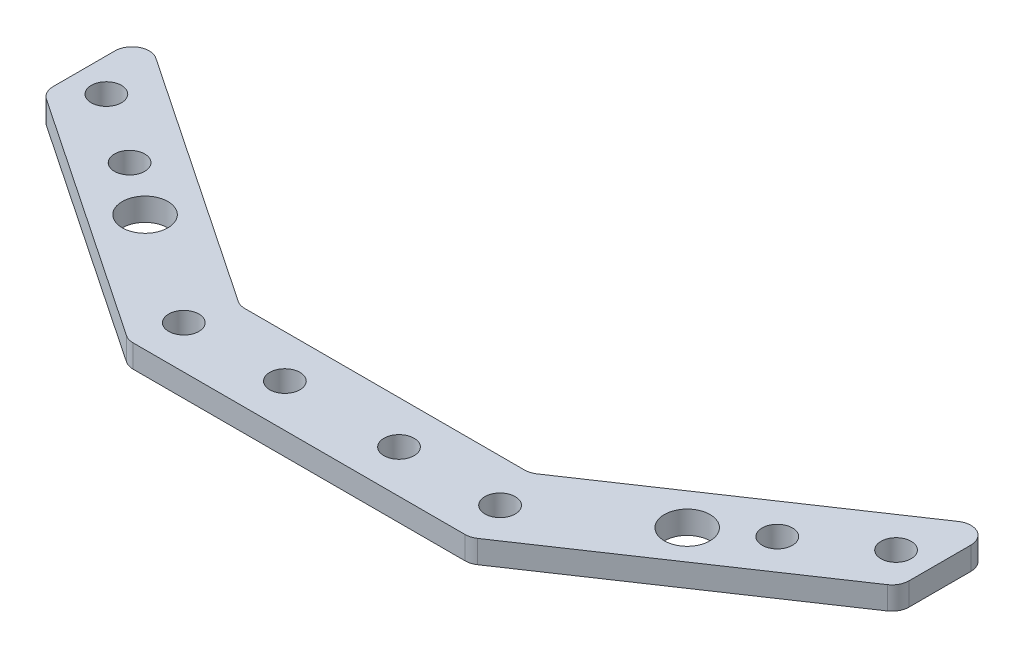
ISO-10303-21;
HEADER;
FILE_DESCRIPTION(('STEP AP214'),'2;1');
FILE_NAME('part.step','',(''),(''),'','','');
FILE_SCHEMA(('AUTOMOTIVE_DESIGN { 1 0 10303 214 1 1 1 1 }'));
ENDSEC;
DATA;
#1=APPLICATION_CONTEXT('core data for automotive mechanical design processes');
#2=APPLICATION_PROTOCOL_DEFINITION('international standard','automotive_design',2000,#1);
#3=PRODUCT_CONTEXT('',#1,'mechanical');
#4=PRODUCT('Part','Part','',(#3));
#5=PRODUCT_RELATED_PRODUCT_CATEGORY('part','',(#4));
#6=PRODUCT_DEFINITION_FORMATION('','',#4);
#7=PRODUCT_DEFINITION_CONTEXT('part definition',#1,'design');
#8=PRODUCT_DEFINITION('design','',#6,#7);
#9=PRODUCT_DEFINITION_SHAPE('','',#8);
#10=(LENGTH_UNIT() NAMED_UNIT(*) SI_UNIT(.MILLI.,.METRE.));
#11=(NAMED_UNIT(*) PLANE_ANGLE_UNIT() SI_UNIT($,.RADIAN.));
#12=(NAMED_UNIT(*) SI_UNIT($,.STERADIAN.) SOLID_ANGLE_UNIT());
#13=UNCERTAINTY_MEASURE_WITH_UNIT(LENGTH_MEASURE(1.E-05),#10,'distance_accuracy_value','');
#14=(GEOMETRIC_REPRESENTATION_CONTEXT(3) GLOBAL_UNCERTAINTY_ASSIGNED_CONTEXT((#13)) GLOBAL_UNIT_ASSIGNED_CONTEXT((#10,
#11,#12)) REPRESENTATION_CONTEXT('',''));
#15=CARTESIAN_POINT('',(0.,0.,0.));
#16=DIRECTION('',(0.,0.,1.));
#17=DIRECTION('',(1.,0.,0.));
#18=AXIS2_PLACEMENT_3D('',#15,#16,#17);
#19=CARTESIAN_POINT('',(0.,20.,0.));
#20=DIRECTION('',(0.,1.,0.));
#21=DIRECTION('',(0.,0.,1.));
#22=AXIS2_PLACEMENT_3D('',#19,#20,#21);
#23=PLANE('',#22);
#24=CARTESIAN_POINT('',(-47.5000000000011,20.,-205.5));
#25=DIRECTION('',(0.,-1.,0.));
#26=DIRECTION('',(0.,0.,-1.));
#27=AXIS2_PLACEMENT_3D('',#24,#25,#26);
#28=CIRCLE('',#27,4.00000000000001);
#29=CARTESIAN_POINT('',(-47.5000000000011,20.,-209.5));
#30=VERTEX_POINT('',#29);
#31=EDGE_CURVE('E398',#30,#30,#28,.T.);
#32=ORIENTED_EDGE('',*,*,#31,.T.);
#33=EDGE_LOOP('',(#32));
#34=FACE_BOUND('',#33,.T.);
#35=CARTESIAN_POINT('',(47.5000000000014,20.,-205.499999999999));
#36=DIRECTION('',(0.,-1.,0.));
#37=DIRECTION('',(0.,0.,1.));
#38=AXIS2_PLACEMENT_3D('',#35,#36,#37);
#39=CIRCLE('',#38,4.00000000000001);
#40=CARTESIAN_POINT('',(47.5000000000014,20.,-201.499999999999));
#41=VERTEX_POINT('',#40);
#42=EDGE_CURVE('E595',#41,#41,#39,.T.);
#43=ORIENTED_EDGE('',*,*,#42,.T.);
#44=EDGE_LOOP('',(#43));
#45=FACE_BOUND('',#44,.T.);
#46=CARTESIAN_POINT('',(10.,20.,-192.5));
#47=DIRECTION('',(0.,1.,0.));
#48=DIRECTION('',(0.,0.,-1.));
#49=AXIS2_PLACEMENT_3D('',#46,#47,#48);
#50=CIRCLE('',#49,2.65000000000001);
#51=CARTESIAN_POINT('',(10.,20.,-195.15));
#52=VERTEX_POINT('',#51);
#53=EDGE_CURVE('E222',#52,#52,#50,.T.);
#54=ORIENTED_EDGE('',*,*,#53,.F.);
#55=EDGE_LOOP('',(#54));
#56=FACE_BOUND('',#55,.T.);
#57=CARTESIAN_POINT('',(27.7116277384566,20.,-192.5));
#58=DIRECTION('',(0.,1.,0.));
#59=DIRECTION('',(0.,0.,-1.));
#60=AXIS2_PLACEMENT_3D('',#57,#58,#59);
#61=CIRCLE('',#60,2.65);
#62=CARTESIAN_POINT('',(27.7116277384566,20.,-195.15));
#63=VERTEX_POINT('',#62);
#64=EDGE_CURVE('E201',#63,#63,#61,.T.);
#65=ORIENTED_EDGE('',*,*,#64,.F.);
#66=EDGE_LOOP('',(#65));
#67=FACE_BOUND('',#66,.T.);
#68=CARTESIAN_POINT('',(69.1949044966264,20.,-220.413039057134));
#69=DIRECTION('',(0.,1.,0.));
#70=DIRECTION('',(0.,0.,-1.));
#71=AXIS2_PLACEMENT_3D('',#68,#69,#70);
#72=CIRCLE('',#71,2.65);
#73=CARTESIAN_POINT('',(69.1949044966264,20.,-223.063039057134));
#74=VERTEX_POINT('',#73);
#75=EDGE_CURVE('E205',#74,#74,#72,.T.);
#76=ORIENTED_EDGE('',*,*,#75,.F.);
#77=EDGE_LOOP('',(#76));
#78=FACE_BOUND('',#77,.T.);
#79=CARTESIAN_POINT('',(56.7499214691754,20.,-212.039127339994));
#80=DIRECTION('',(0.,1.,0.));
#81=DIRECTION('',(0.,0.,-1.));
#82=AXIS2_PLACEMENT_3D('',#79,#80,#81);
#83=CIRCLE('',#82,2.65);
#84=CARTESIAN_POINT('',(56.7499214691754,20.,-214.689127339994));
#85=VERTEX_POINT('',#84);
#86=EDGE_CURVE('E202',#85,#85,#83,.T.);
#87=ORIENTED_EDGE('',*,*,#86,.F.);
#88=EDGE_LOOP('',(#87));
#89=FACE_BOUND('',#88,.T.);
#90=CARTESIAN_POINT('',(-56.7499214691754,20.,-212.039127339994));
#91=DIRECTION('',(0.,1.,0.));
#92=DIRECTION('',(0.,0.,1.));
#93=AXIS2_PLACEMENT_3D('',#90,#91,#92);
#94=CIRCLE('',#93,2.65);
#95=CARTESIAN_POINT('',(-56.7499214691754,20.,-209.389127339994));
#96=VERTEX_POINT('',#95);
#97=EDGE_CURVE('E211',#96,#96,#94,.T.);
#98=ORIENTED_EDGE('',*,*,#97,.F.);
#99=EDGE_LOOP('',(#98));
#100=FACE_BOUND('',#99,.T.);
#101=CARTESIAN_POINT('',(-69.1949044966264,20.,-220.413039057134));
#102=DIRECTION('',(0.,1.,0.));
#103=DIRECTION('',(0.,0.,1.));
#104=AXIS2_PLACEMENT_3D('',#101,#102,#103);
#105=CIRCLE('',#104,2.65);
#106=CARTESIAN_POINT('',(-69.1949044966264,20.,-217.763039057134));
#107=VERTEX_POINT('',#106);
#108=EDGE_CURVE('E208',#107,#107,#105,.T.);
#109=ORIENTED_EDGE('',*,*,#108,.F.);
#110=EDGE_LOOP('',(#109));
#111=FACE_BOUND('',#110,.T.);
#112=CARTESIAN_POINT('',(-10.,20.,-192.5));
#113=DIRECTION('',(0.,1.,0.));
#114=DIRECTION('',(0.,0.,1.));
#115=AXIS2_PLACEMENT_3D('',#112,#113,#114);
#116=CIRCLE('',#115,2.65000000000001);
#117=CARTESIAN_POINT('',(-10.,20.,-189.85));
#118=VERTEX_POINT('',#117);
#119=EDGE_CURVE('E219',#118,#118,#116,.T.);
#120=ORIENTED_EDGE('',*,*,#119,.F.);
#121=EDGE_LOOP('',(#120));
#122=FACE_BOUND('',#121,.T.);
#123=CARTESIAN_POINT('',(-27.7116277384566,20.,-192.5));
#124=DIRECTION('',(0.,1.,0.));
#125=DIRECTION('',(0.,0.,1.));
#126=AXIS2_PLACEMENT_3D('',#123,#124,#125);
#127=CIRCLE('',#126,2.65);
#128=CARTESIAN_POINT('',(-27.7116277384566,20.,-189.85));
#129=VERTEX_POINT('',#128);
#130=EDGE_CURVE('E214',#129,#129,#127,.T.);
#131=ORIENTED_EDGE('',*,*,#130,.F.);
#132=EDGE_LOOP('',(#131));
#133=FACE_BOUND('',#132,.T.);
#134=DIRECTION('',(0.,0.,-1.));
#135=VECTOR('',#134,1.);
#136=CARTESIAN_POINT('',(75.,20.,-233.358927122987));
#137=LINE('',#136,#135);
#138=CARTESIAN_POINT('',(75.,20.,-216.876643884917));
#139=VERTEX_POINT('',#138);
#140=CARTESIAN_POINT('',(75.,20.,-227.724388691175));
#141=VERTEX_POINT('',#140);
#142=EDGE_CURVE('E198',#139,#141,#137,.T.);
#143=ORIENTED_EDGE('',*,*,#142,.T.);
#144=CARTESIAN_POINT('',(72.,20.,-227.724388691175));
#145=DIRECTION('',(0.,1.,0.));
#146=DIRECTION('',(0.,0.,1.));
#147=AXIS2_PLACEMENT_3D('',#144,#145,#146);
#148=CIRCLE('',#147,3.);
#149=CARTESIAN_POINT('',(70.325217656572,20.,-230.213385296665));
#150=VERTEX_POINT('',#149);
#151=EDGE_CURVE('E267',#141,#150,#148,.T.);
#152=ORIENTED_EDGE('',*,*,#151,.T.);
#153=DIRECTION('',(-0.829665535163397,0.,0.55826078114268));
#154=VECTOR('',#153,1.);
#155=CARTESIAN_POINT('',(110.52513989388,20.,-257.262887823794));
#156=LINE('',#155,#154);
#157=CARTESIAN_POINT('',(26.1826889157237,20.,-200.51100339451));
#158=VERTEX_POINT('',#157);
#159=EDGE_CURVE('E234',#150,#158,#156,.T.);
#160=ORIENTED_EDGE('',*,*,#159,.T.);
#161=CARTESIAN_POINT('',(24.5079065722957,20.,-203.));
#162=DIRECTION('',(0.,1.,0.));
#163=DIRECTION('',(0.,0.,1.));
#164=AXIS2_PLACEMENT_3D('',#161,#162,#163);
#165=CIRCLE('',#164,3.);
#166=CARTESIAN_POINT('',(24.5079065722957,20.,-200.));
#167=VERTEX_POINT('',#166);
#168=EDGE_CURVE('E12',#158,#167,#165,.F.);
#169=ORIENTED_EDGE('',*,*,#168,.T.);
#170=DIRECTION('',(-1.,0.,0.));
#171=VECTOR('',#170,1.);
#172=CARTESIAN_POINT('',(0.,20.,-200.));
#173=LINE('',#172,#171);
#174=CARTESIAN_POINT('',(-24.5079065722956,20.,-200.));
#175=VERTEX_POINT('',#174);
#176=EDGE_CURVE('E237',#167,#175,#173,.T.);
#177=ORIENTED_EDGE('',*,*,#176,.T.);
#178=CARTESIAN_POINT('',(-24.5079065722957,20.,-203.));
#179=DIRECTION('',(0.,1.,0.));
#180=DIRECTION('',(0.,0.,1.));
#181=AXIS2_PLACEMENT_3D('',#178,#179,#180);
#182=CIRCLE('',#181,3.);
#183=CARTESIAN_POINT('',(-26.1826889157237,20.,-200.51100339451));
#184=VERTEX_POINT('',#183);
#185=EDGE_CURVE('E161',#175,#184,#182,.F.);
#186=ORIENTED_EDGE('',*,*,#185,.T.);
#187=DIRECTION('',(-0.829665535163396,0.,-0.55826078114268));
#188=VECTOR('',#187,1.);
#189=CARTESIAN_POINT('',(-110.52513989388,20.,-257.262887823794));
#190=LINE('',#189,#188);
#191=CARTESIAN_POINT('',(-70.325217656572,20.,-230.213385296665));
#192=VERTEX_POINT('',#191);
#193=EDGE_CURVE('E172',#184,#192,#190,.T.);
#194=ORIENTED_EDGE('',*,*,#193,.T.);
#195=CARTESIAN_POINT('',(-72.,20.,-227.724388691175));
#196=DIRECTION('',(0.,1.,0.));
#197=DIRECTION('',(0.,0.,1.));
#198=AXIS2_PLACEMENT_3D('',#195,#196,#197);
#199=CIRCLE('',#198,3.);
#200=CARTESIAN_POINT('',(-75.,20.,-227.724388691175));
#201=VERTEX_POINT('',#200);
#202=EDGE_CURVE('E257',#192,#201,#199,.T.);
#203=ORIENTED_EDGE('',*,*,#202,.T.);
#204=DIRECTION('',(0.,0.,1.));
#205=VECTOR('',#204,1.);
#206=CARTESIAN_POINT('',(-75.,20.,-233.358927122987));
#207=LINE('',#206,#205);
#208=CARTESIAN_POINT('',(-75.,20.,-216.876643884917));
#209=VERTEX_POINT('',#208);
#210=EDGE_CURVE('E195',#201,#209,#207,.T.);
#211=ORIENTED_EDGE('',*,*,#210,.T.);
#212=CARTESIAN_POINT('',(-72.,20.,-216.876643884917));
#213=DIRECTION('',(0.,1.,0.));
#214=DIRECTION('',(0.,0.,1.));
#215=AXIS2_PLACEMENT_3D('',#212,#213,#214);
#216=CIRCLE('',#215,3.);
#217=CARTESIAN_POINT('',(-73.674782343428,20.,-214.387647279427));
#218=VERTEX_POINT('',#217);
#219=EDGE_CURVE('E259',#209,#218,#216,.T.);
#220=ORIENTED_EDGE('',*,*,#219,.T.);
#221=DIRECTION('',(-0.829665535163396,0.,-0.55826078114268));
#222=VECTOR('',#221,1.);
#223=CARTESIAN_POINT('',(-111.993839361285,20.,-240.171563564712));
#224=LINE('',#223,#222);
#225=CARTESIAN_POINT('',(-30.7594334388107,20.,-185.51100339451));
#226=VERTEX_POINT('',#225);
#227=EDGE_CURVE('E231',#226,#218,#224,.T.);
#228=ORIENTED_EDGE('',*,*,#227,.F.);
#229=CARTESIAN_POINT('',(-29.0846510953827,20.,-188.));
#230=DIRECTION('',(0.,1.,0.));
#231=DIRECTION('',(0.,0.,1.));
#232=AXIS2_PLACEMENT_3D('',#229,#230,#231);
#233=CIRCLE('',#232,3.);
#234=CARTESIAN_POINT('',(-29.0846510953827,20.,-185.));
#235=VERTEX_POINT('',#234);
#236=EDGE_CURVE('E261',#226,#235,#233,.T.);
#237=ORIENTED_EDGE('',*,*,#236,.T.);
#238=DIRECTION('',(-1.,0.,0.));
#239=VECTOR('',#238,1.);
#240=CARTESIAN_POINT('',(0.,20.,-185.));
#241=LINE('',#240,#239);
#242=CARTESIAN_POINT('',(29.0846510953828,20.,-185.));
#243=VERTEX_POINT('',#242);
#244=EDGE_CURVE('E228',#243,#235,#241,.T.);
#245=ORIENTED_EDGE('',*,*,#244,.F.);
#246=CARTESIAN_POINT('',(29.0846510953828,20.,-188.));
#247=DIRECTION('',(0.,1.,0.));
#248=DIRECTION('',(0.,0.,1.));
#249=AXIS2_PLACEMENT_3D('',#246,#247,#248);
#250=CIRCLE('',#249,3.);
#251=CARTESIAN_POINT('',(30.7594334388108,20.,-185.51100339451));
#252=VERTEX_POINT('',#251);
#253=EDGE_CURVE('E263',#243,#252,#250,.T.);
#254=ORIENTED_EDGE('',*,*,#253,.T.);
#255=DIRECTION('',(-0.829665535163396,0.,0.55826078114268));
#256=VECTOR('',#255,1.);
#257=CARTESIAN_POINT('',(111.993839361285,20.,-240.171563564712));
#258=LINE('',#257,#256);
#259=CARTESIAN_POINT('',(73.674782343428,20.,-214.387647279427));
#260=VERTEX_POINT('',#259);
#261=EDGE_CURVE('E225',#260,#252,#258,.T.);
#262=ORIENTED_EDGE('',*,*,#261,.F.);
#263=CARTESIAN_POINT('',(72.,20.,-216.876643884917));
#264=DIRECTION('',(0.,1.,0.));
#265=DIRECTION('',(0.,0.,1.));
#266=AXIS2_PLACEMENT_3D('',#263,#264,#265);
#267=CIRCLE('',#266,3.);
#268=EDGE_CURVE('E265',#260,#139,#267,.T.);
#269=ORIENTED_EDGE('',*,*,#268,.T.);
#270=EDGE_LOOP('',(#143,#152,#160,#169,#177,#186,#194,#203,#211,#220,#228,#237,#245,#254,#262,#269));
#271=FACE_BOUND('',#270,.T.);
#272=ADVANCED_FACE('F39',(#34,#45,#56,#67,#78,#89,#100,#111,#122,#133,#271),#23,.T.);
#273=CARTESIAN_POINT('',(110.52513989388,20.,-257.262887823794));
#274=DIRECTION('',(0.55826078114268,0.,0.829665535163397));
#275=DIRECTION('',(0.829665535163396,0.,-0.55826078114268));
#276=AXIS2_PLACEMENT_3D('',#273,#274,#275);
#277=PLANE('',#276);
#278=DIRECTION('',(-0.829665535163396,0.,0.55826078114268));
#279=VECTOR('',#278,1.);
#280=CARTESIAN_POINT('',(110.52513989388,16.,-257.262887823794));
#281=LINE('',#280,#279);
#282=CARTESIAN_POINT('',(70.325217656572,16.,-230.213385296665));
#283=VERTEX_POINT('',#282);
#284=CARTESIAN_POINT('',(26.1826889157237,16.,-200.51100339451));
#285=VERTEX_POINT('',#284);
#286=EDGE_CURVE('E181',#283,#285,#281,.T.);
#287=ORIENTED_EDGE('',*,*,#286,.T.);
#288=DIRECTION('',(0.,-1.,0.));
#289=VECTOR('',#288,1.);
#290=CARTESIAN_POINT('',(26.1826889157237,20.,-200.51100339451));
#291=LINE('',#290,#289);
#292=EDGE_CURVE('E250',#285,#158,#291,.F.);
#293=ORIENTED_EDGE('',*,*,#292,.T.);
#294=ORIENTED_EDGE('',*,*,#159,.F.);
#295=DIRECTION('',(0.,1.,0.));
#296=VECTOR('',#295,1.);
#297=CARTESIAN_POINT('',(70.325217656572,16.,-230.213385296665));
#298=LINE('',#297,#296);
#299=EDGE_CURVE('E248',#150,#283,#298,.F.);
#300=ORIENTED_EDGE('',*,*,#299,.T.);
#301=EDGE_LOOP('',(#287,#293,#294,#300));
#302=FACE_BOUND('',#301,.T.);
#303=ADVANCED_FACE('F302',(#302),#277,.F.);
#304=CARTESIAN_POINT('',(-110.52513989388,20.,-257.262887823794));
#305=DIRECTION('',(-0.55826078114268,0.,0.829665535163396));
#306=DIRECTION('',(0.829665535163396,0.,0.55826078114268));
#307=AXIS2_PLACEMENT_3D('',#304,#305,#306);
#308=PLANE('',#307);
#309=ORIENTED_EDGE('',*,*,#193,.F.);
#310=DIRECTION('',(0.,-1.,0.));
#311=VECTOR('',#310,1.);
#312=CARTESIAN_POINT('',(-26.1826889157237,16.,-200.51100339451));
#313=LINE('',#312,#311);
#314=CARTESIAN_POINT('',(-26.1826889157237,16.,-200.51100339451));
#315=VERTEX_POINT('',#314);
#316=EDGE_CURVE('E156',#184,#315,#313,.T.);
#317=ORIENTED_EDGE('',*,*,#316,.T.);
#318=DIRECTION('',(-0.829665535163396,0.,-0.55826078114268));
#319=VECTOR('',#318,1.);
#320=CARTESIAN_POINT('',(-110.52513989388,16.,-257.262887823794));
#321=LINE('',#320,#319);
#322=CARTESIAN_POINT('',(-70.3252176565719,16.,-230.213385296665));
#323=VERTEX_POINT('',#322);
#324=EDGE_CURVE('E169',#315,#323,#321,.T.);
#325=ORIENTED_EDGE('',*,*,#324,.T.);
#326=DIRECTION('',(0.,1.,0.));
#327=VECTOR('',#326,1.);
#328=CARTESIAN_POINT('',(-70.325217656572,20.,-230.213385296665));
#329=LINE('',#328,#327);
#330=EDGE_CURVE('E174',#323,#192,#329,.T.);
#331=ORIENTED_EDGE('',*,*,#330,.T.);
#332=EDGE_LOOP('',(#309,#317,#325,#331));
#333=FACE_BOUND('',#332,.T.);
#334=ADVANCED_FACE('F167',(#333),#308,.F.);
#335=CARTESIAN_POINT('',(111.993839361285,20.,-240.171563564712));
#336=DIRECTION('',(0.55826078114268,0.,0.829665535163396));
#337=DIRECTION('',(0.829665535163396,0.,-0.55826078114268));
#338=AXIS2_PLACEMENT_3D('',#335,#336,#337);
#339=PLANE('',#338);
#340=DIRECTION('',(-0.829665535163396,0.,0.55826078114268));
#341=VECTOR('',#340,1.);
#342=CARTESIAN_POINT('',(111.993839361285,16.,-240.171563564712));
#343=LINE('',#342,#341);
#344=CARTESIAN_POINT('',(73.674782343428,16.,-214.387647279427));
#345=VERTEX_POINT('',#344);
#346=CARTESIAN_POINT('',(30.7594334388108,16.,-185.51100339451));
#347=VERTEX_POINT('',#346);
#348=EDGE_CURVE('E192',#345,#347,#343,.T.);
#349=ORIENTED_EDGE('',*,*,#348,.F.);
#350=DIRECTION('',(0.,1.,0.));
#351=VECTOR('',#350,1.);
#352=CARTESIAN_POINT('',(73.674782343428,20.,-214.387647279427));
#353=LINE('',#352,#351);
#354=EDGE_CURVE('E282',#345,#260,#353,.T.);
#355=ORIENTED_EDGE('',*,*,#354,.T.);
#356=ORIENTED_EDGE('',*,*,#261,.T.);
#357=DIRECTION('',(0.,-1.,0.));
#358=VECTOR('',#357,1.);
#359=CARTESIAN_POINT('',(30.7594334388108,20.,-185.51100339451));
#360=LINE('',#359,#358);
#361=EDGE_CURVE('E279',#252,#347,#360,.T.);
#362=ORIENTED_EDGE('',*,*,#361,.T.);
#363=EDGE_LOOP('',(#349,#355,#356,#362));
#364=FACE_BOUND('',#363,.T.);
#365=ADVANCED_FACE('F322',(#364),#339,.T.);
#366=CARTESIAN_POINT('',(-111.993839361285,20.,-240.171563564712));
#367=DIRECTION('',(-0.55826078114268,0.,0.829665535163396));
#368=DIRECTION('',(0.829665535163396,0.,0.55826078114268));
#369=AXIS2_PLACEMENT_3D('',#366,#367,#368);
#370=PLANE('',#369);
#371=DIRECTION('',(-0.829665535163396,0.,-0.55826078114268));
#372=VECTOR('',#371,1.);
#373=CARTESIAN_POINT('',(-111.993839361285,16.,-240.171563564712));
#374=LINE('',#373,#372);
#375=CARTESIAN_POINT('',(-30.7594334388107,16.,-185.51100339451));
#376=VERTEX_POINT('',#375);
#377=CARTESIAN_POINT('',(-73.674782343428,16.,-214.387647279427));
#378=VERTEX_POINT('',#377);
#379=EDGE_CURVE('E185',#376,#378,#374,.T.);
#380=ORIENTED_EDGE('',*,*,#379,.F.);
#381=DIRECTION('',(0.,-1.,0.));
#382=VECTOR('',#381,1.);
#383=CARTESIAN_POINT('',(-30.7594334388107,20.,-185.51100339451));
#384=LINE('',#383,#382);
#385=EDGE_CURVE('E293',#376,#226,#384,.F.);
#386=ORIENTED_EDGE('',*,*,#385,.T.);
#387=ORIENTED_EDGE('',*,*,#227,.T.);
#388=DIRECTION('',(0.,-1.,0.));
#389=VECTOR('',#388,1.);
#390=CARTESIAN_POINT('',(-73.674782343428,20.,-214.387647279427));
#391=LINE('',#390,#389);
#392=EDGE_CURVE('E290',#218,#378,#391,.T.);
#393=ORIENTED_EDGE('',*,*,#392,.T.);
#394=EDGE_LOOP('',(#380,#386,#387,#393));
#395=FACE_BOUND('',#394,.T.);
#396=ADVANCED_FACE('F313',(#395),#370,.T.);
#397=CARTESIAN_POINT('',(0.,20.,-200.));
#398=DIRECTION('',(0.,0.,1.));
#399=DIRECTION('',(1.,0.,0.));
#400=AXIS2_PLACEMENT_3D('',#397,#398,#399);
#401=PLANE('',#400);
#402=DIRECTION('',(-1.,0.,0.));
#403=VECTOR('',#402,1.);
#404=CARTESIAN_POINT('',(0.,16.,-200.));
#405=LINE('',#404,#403);
#406=CARTESIAN_POINT('',(24.5079065722957,16.,-200.));
#407=VERTEX_POINT('',#406);
#408=CARTESIAN_POINT('',(-24.5079065722957,16.,-200.));
#409=VERTEX_POINT('',#408);
#410=EDGE_CURVE('E182',#407,#409,#405,.T.);
#411=ORIENTED_EDGE('',*,*,#410,.T.);
#412=DIRECTION('',(0.,-1.,0.));
#413=VECTOR('',#412,1.);
#414=CARTESIAN_POINT('',(-24.5079065722957,20.,-200.));
#415=LINE('',#414,#413);
#416=EDGE_CURVE('E157',#409,#175,#415,.F.);
#417=ORIENTED_EDGE('',*,*,#416,.T.);
#418=ORIENTED_EDGE('',*,*,#176,.F.);
#419=DIRECTION('',(0.,-1.,0.));
#420=VECTOR('',#419,1.);
#421=CARTESIAN_POINT('',(24.5079065722957,16.,-200.));
#422=LINE('',#421,#420);
#423=EDGE_CURVE('E173',#167,#407,#422,.T.);
#424=ORIENTED_EDGE('',*,*,#423,.T.);
#425=EDGE_LOOP('',(#411,#417,#418,#424));
#426=FACE_BOUND('',#425,.T.);
#427=ADVANCED_FACE('F310',(#426),#401,.F.);
#428=CARTESIAN_POINT('',(0.,20.,-185.));
#429=DIRECTION('',(0.,0.,1.));
#430=DIRECTION('',(1.,0.,0.));
#431=AXIS2_PLACEMENT_3D('',#428,#429,#430);
#432=PLANE('',#431);
#433=DIRECTION('',(-1.,0.,0.));
#434=VECTOR('',#433,1.);
#435=CARTESIAN_POINT('',(-75.0000000000004,16.,-185.));
#436=LINE('',#435,#434);
#437=CARTESIAN_POINT('',(29.0846510953828,16.,-185.));
#438=VERTEX_POINT('',#437);
#439=CARTESIAN_POINT('',(-29.0846510953827,16.,-185.));
#440=VERTEX_POINT('',#439);
#441=EDGE_CURVE('E396',#438,#440,#436,.T.);
#442=ORIENTED_EDGE('',*,*,#441,.F.);
#443=DIRECTION('',(0.,-1.,0.));
#444=VECTOR('',#443,1.);
#445=CARTESIAN_POINT('',(29.0846510953828,20.,-185.));
#446=LINE('',#445,#444);
#447=EDGE_CURVE('E288',#438,#243,#446,.F.);
#448=ORIENTED_EDGE('',*,*,#447,.T.);
#449=ORIENTED_EDGE('',*,*,#244,.T.);
#450=DIRECTION('',(0.,-1.,0.));
#451=VECTOR('',#450,1.);
#452=CARTESIAN_POINT('',(-29.0846510953827,20.,-185.));
#453=LINE('',#452,#451);
#454=EDGE_CURVE('E285',#235,#440,#453,.T.);
#455=ORIENTED_EDGE('',*,*,#454,.T.);
#456=EDGE_LOOP('',(#442,#448,#449,#455));
#457=FACE_BOUND('',#456,.T.);
#458=ADVANCED_FACE('F312',(#457),#432,.T.);
#459=CARTESIAN_POINT('',(10.,0.,-192.5));
#460=DIRECTION('',(0.,1.,0.));
#461=DIRECTION('',(0.,0.,1.));
#462=AXIS2_PLACEMENT_3D('',#459,#460,#461);
#463=CYLINDRICAL_SURFACE('',#462,2.65000000000001);
#464=CARTESIAN_POINT('',(10.,16.,-192.5));
#465=DIRECTION('',(0.,1.,0.));
#466=DIRECTION('',(0.,0.,1.));
#467=AXIS2_PLACEMENT_3D('',#464,#465,#466);
#468=CIRCLE('',#467,2.65000000000001);
#469=CARTESIAN_POINT('',(10.,16.,-189.85));
#470=VERTEX_POINT('',#469);
#471=EDGE_CURVE('E187',#470,#470,#468,.F.);
#472=ORIENTED_EDGE('',*,*,#471,.T.);
#473=EDGE_LOOP('',(#472));
#474=FACE_BOUND('',#473,.T.);
#475=ORIENTED_EDGE('',*,*,#53,.T.);
#476=EDGE_LOOP('',(#475));
#477=FACE_BOUND('',#476,.T.);
#478=ADVANCED_FACE('F319',(#474,#477),#463,.F.);
#479=CARTESIAN_POINT('',(27.7116277384566,0.,-192.5));
#480=DIRECTION('',(0.,1.,0.));
#481=DIRECTION('',(0.,0.,1.));
#482=AXIS2_PLACEMENT_3D('',#479,#480,#481);
#483=CYLINDRICAL_SURFACE('',#482,2.65);
#484=CARTESIAN_POINT('',(27.7116277384566,16.,-192.5));
#485=DIRECTION('',(0.,1.,0.));
#486=DIRECTION('',(0.,0.,1.));
#487=AXIS2_PLACEMENT_3D('',#484,#485,#486);
#488=CIRCLE('',#487,2.65);
#489=CARTESIAN_POINT('',(27.7116277384566,16.,-189.85));
#490=VERTEX_POINT('',#489);
#491=EDGE_CURVE('E425',#490,#490,#488,.F.);
#492=ORIENTED_EDGE('',*,*,#491,.T.);
#493=EDGE_LOOP('',(#492));
#494=FACE_BOUND('',#493,.T.);
#495=ORIENTED_EDGE('',*,*,#64,.T.);
#496=EDGE_LOOP('',(#495));
#497=FACE_BOUND('',#496,.T.);
#498=ADVANCED_FACE('F457',(#494,#497),#483,.F.);
#499=CARTESIAN_POINT('',(69.1949044966264,0.,-220.413039057134));
#500=DIRECTION('',(0.,1.,0.));
#501=DIRECTION('',(0.,0.,1.));
#502=AXIS2_PLACEMENT_3D('',#499,#500,#501);
#503=CYLINDRICAL_SURFACE('',#502,2.65);
#504=CARTESIAN_POINT('',(69.1949044966264,16.,-220.413039057134));
#505=DIRECTION('',(0.,1.,0.));
#506=DIRECTION('',(0.,0.,1.));
#507=AXIS2_PLACEMENT_3D('',#504,#505,#506);
#508=CIRCLE('',#507,2.65);
#509=CARTESIAN_POINT('',(69.1949044966264,16.,-217.763039057134));
#510=VERTEX_POINT('',#509);
#511=EDGE_CURVE('E422',#510,#510,#508,.F.);
#512=ORIENTED_EDGE('',*,*,#511,.T.);
#513=EDGE_LOOP('',(#512));
#514=FACE_BOUND('',#513,.T.);
#515=ORIENTED_EDGE('',*,*,#75,.T.);
#516=EDGE_LOOP('',(#515));
#517=FACE_BOUND('',#516,.T.);
#518=ADVANCED_FACE('F453',(#514,#517),#503,.F.);
#519=CARTESIAN_POINT('',(56.7499214691754,0.,-212.039127339994));
#520=DIRECTION('',(0.,1.,0.));
#521=DIRECTION('',(0.,0.,1.));
#522=AXIS2_PLACEMENT_3D('',#519,#520,#521);
#523=CYLINDRICAL_SURFACE('',#522,2.65);
#524=CARTESIAN_POINT('',(56.7499214691754,16.,-212.039127339994));
#525=DIRECTION('',(0.,1.,0.));
#526=DIRECTION('',(0.,0.,1.));
#527=AXIS2_PLACEMENT_3D('',#524,#525,#526);
#528=CIRCLE('',#527,2.65);
#529=CARTESIAN_POINT('',(56.7499214691754,16.,-209.389127339994));
#530=VERTEX_POINT('',#529);
#531=EDGE_CURVE('E419',#530,#530,#528,.F.);
#532=ORIENTED_EDGE('',*,*,#531,.T.);
#533=EDGE_LOOP('',(#532));
#534=FACE_BOUND('',#533,.T.);
#535=ORIENTED_EDGE('',*,*,#86,.T.);
#536=EDGE_LOOP('',(#535));
#537=FACE_BOUND('',#536,.T.);
#538=ADVANCED_FACE('F449',(#534,#537),#523,.F.);
#539=CARTESIAN_POINT('',(-56.7499214691754,0.,-212.039127339994));
#540=DIRECTION('',(0.,1.,0.));
#541=DIRECTION('',(0.,0.,1.));
#542=AXIS2_PLACEMENT_3D('',#539,#540,#541);
#543=CYLINDRICAL_SURFACE('',#542,2.65);
#544=CARTESIAN_POINT('',(-56.7499214691754,16.,-212.039127339994));
#545=DIRECTION('',(0.,1.,0.));
#546=DIRECTION('',(0.,0.,1.));
#547=AXIS2_PLACEMENT_3D('',#544,#545,#546);
#548=CIRCLE('',#547,2.65);
#549=CARTESIAN_POINT('',(-56.7499214691754,16.,-209.389127339994));
#550=VERTEX_POINT('',#549);
#551=EDGE_CURVE('E416',#550,#550,#548,.F.);
#552=ORIENTED_EDGE('',*,*,#551,.T.);
#553=EDGE_LOOP('',(#552));
#554=FACE_BOUND('',#553,.T.);
#555=ORIENTED_EDGE('',*,*,#97,.T.);
#556=EDGE_LOOP('',(#555));
#557=FACE_BOUND('',#556,.T.);
#558=ADVANCED_FACE('F452',(#554,#557),#543,.F.);
#559=CARTESIAN_POINT('',(-69.1949044966264,0.,-220.413039057134));
#560=DIRECTION('',(0.,1.,0.));
#561=DIRECTION('',(0.,0.,1.));
#562=AXIS2_PLACEMENT_3D('',#559,#560,#561);
#563=CYLINDRICAL_SURFACE('',#562,2.65);
#564=CARTESIAN_POINT('',(-69.1949044966264,16.,-220.413039057134));
#565=DIRECTION('',(0.,1.,0.));
#566=DIRECTION('',(0.,0.,1.));
#567=AXIS2_PLACEMENT_3D('',#564,#565,#566);
#568=CIRCLE('',#567,2.65);
#569=CARTESIAN_POINT('',(-69.1949044966264,16.,-217.763039057134));
#570=VERTEX_POINT('',#569);
#571=EDGE_CURVE('E413',#570,#570,#568,.F.);
#572=ORIENTED_EDGE('',*,*,#571,.T.);
#573=EDGE_LOOP('',(#572));
#574=FACE_BOUND('',#573,.T.);
#575=ORIENTED_EDGE('',*,*,#108,.T.);
#576=EDGE_LOOP('',(#575));
#577=FACE_BOUND('',#576,.T.);
#578=ADVANCED_FACE('F464',(#574,#577),#563,.F.);
#579=CARTESIAN_POINT('',(-10.,0.,-192.5));
#580=DIRECTION('',(0.,1.,0.));
#581=DIRECTION('',(0.,0.,1.));
#582=AXIS2_PLACEMENT_3D('',#579,#580,#581);
#583=CYLINDRICAL_SURFACE('',#582,2.65000000000001);
#584=CARTESIAN_POINT('',(-10.,16.,-192.5));
#585=DIRECTION('',(0.,1.,0.));
#586=DIRECTION('',(0.,0.,1.));
#587=AXIS2_PLACEMENT_3D('',#584,#585,#586);
#588=CIRCLE('',#587,2.65000000000001);
#589=CARTESIAN_POINT('',(-10.,16.,-189.85));
#590=VERTEX_POINT('',#589);
#591=EDGE_CURVE('E410',#590,#590,#588,.F.);
#592=ORIENTED_EDGE('',*,*,#591,.T.);
#593=EDGE_LOOP('',(#592));
#594=FACE_BOUND('',#593,.T.);
#595=ORIENTED_EDGE('',*,*,#119,.T.);
#596=EDGE_LOOP('',(#595));
#597=FACE_BOUND('',#596,.T.);
#598=ADVANCED_FACE('F468',(#594,#597),#583,.F.);
#599=CARTESIAN_POINT('',(-27.7116277384566,0.,-192.5));
#600=DIRECTION('',(0.,1.,0.));
#601=DIRECTION('',(0.,0.,1.));
#602=AXIS2_PLACEMENT_3D('',#599,#600,#601);
#603=CYLINDRICAL_SURFACE('',#602,2.65);
#604=CARTESIAN_POINT('',(-27.7116277384566,16.,-192.5));
#605=DIRECTION('',(0.,1.,0.));
#606=DIRECTION('',(0.,0.,1.));
#607=AXIS2_PLACEMENT_3D('',#604,#605,#606);
#608=CIRCLE('',#607,2.65);
#609=CARTESIAN_POINT('',(-27.7116277384566,16.,-189.85));
#610=VERTEX_POINT('',#609);
#611=EDGE_CURVE('E400',#610,#610,#608,.F.);
#612=ORIENTED_EDGE('',*,*,#611,.T.);
#613=EDGE_LOOP('',(#612));
#614=FACE_BOUND('',#613,.T.);
#615=ORIENTED_EDGE('',*,*,#130,.T.);
#616=EDGE_LOOP('',(#615));
#617=FACE_BOUND('',#616,.T.);
#618=ADVANCED_FACE('F448',(#614,#617),#603,.F.);
#619=CARTESIAN_POINT('',(-75.,0.,-233.358927122987));
#620=DIRECTION('',(-1.,0.,0.));
#621=DIRECTION('',(0.,0.,1.));
#622=AXIS2_PLACEMENT_3D('',#619,#620,#621);
#623=PLANE('',#622);
#624=DIRECTION('',(0.,0.,1.));
#625=VECTOR('',#624,1.);
#626=CARTESIAN_POINT('',(-75.0000000000004,16.,-275.));
#627=LINE('',#626,#625);
#628=CARTESIAN_POINT('',(-75.0000000000004,16.,-227.724388691175));
#629=VERTEX_POINT('',#628);
#630=CARTESIAN_POINT('',(-75.0000000000004,16.,-216.876643884917));
#631=VERTEX_POINT('',#630);
#632=EDGE_CURVE('E397',#629,#631,#627,.T.);
#633=ORIENTED_EDGE('',*,*,#632,.T.);
#634=DIRECTION('',(0.,-1.,0.));
#635=VECTOR('',#634,1.);
#636=CARTESIAN_POINT('',(-75.,0.,-216.876643884917));
#637=LINE('',#636,#635);
#638=EDGE_CURVE('E162',#631,#209,#637,.F.);
#639=ORIENTED_EDGE('',*,*,#638,.T.);
#640=ORIENTED_EDGE('',*,*,#210,.F.);
#641=DIRECTION('',(0.,1.,0.));
#642=VECTOR('',#641,1.);
#643=CARTESIAN_POINT('',(-75.,16.,-227.724388691175));
#644=LINE('',#643,#642);
#645=EDGE_CURVE('E61',#201,#629,#644,.F.);
#646=ORIENTED_EDGE('',*,*,#645,.T.);
#647=EDGE_LOOP('',(#633,#639,#640,#646));
#648=FACE_BOUND('',#647,.T.);
#649=ADVANCED_FACE('F439',(#648),#623,.T.);
#650=CARTESIAN_POINT('',(75.,0.,-233.358927122987));
#651=DIRECTION('',(1.,0.,0.));
#652=DIRECTION('',(0.,0.,-1.));
#653=AXIS2_PLACEMENT_3D('',#650,#651,#652);
#654=PLANE('',#653);
#655=DIRECTION('',(0.,0.,1.));
#656=VECTOR('',#655,1.);
#657=CARTESIAN_POINT('',(75.,16.,-233.358927122987));
#658=LINE('',#657,#656);
#659=CARTESIAN_POINT('',(75.,16.,-227.724388691175));
#660=VERTEX_POINT('',#659);
#661=CARTESIAN_POINT('',(75.,16.,-216.876643884917));
#662=VERTEX_POINT('',#661);
#663=EDGE_CURVE('E241',#660,#662,#658,.T.);
#664=ORIENTED_EDGE('',*,*,#663,.F.);
#665=DIRECTION('',(0.,1.,0.));
#666=VECTOR('',#665,1.);
#667=CARTESIAN_POINT('',(75.,20.,-227.724388691175));
#668=LINE('',#667,#666);
#669=EDGE_CURVE('E254',#660,#141,#668,.T.);
#670=ORIENTED_EDGE('',*,*,#669,.T.);
#671=ORIENTED_EDGE('',*,*,#142,.F.);
#672=DIRECTION('',(0.,1.,0.));
#673=VECTOR('',#672,1.);
#674=CARTESIAN_POINT('',(75.,0.,-216.876643884917));
#675=LINE('',#674,#673);
#676=EDGE_CURVE('E252',#139,#662,#675,.F.);
#677=ORIENTED_EDGE('',*,*,#676,.T.);
#678=EDGE_LOOP('',(#664,#670,#671,#677));
#679=FACE_BOUND('',#678,.T.);
#680=ADVANCED_FACE('F354',(#679),#654,.T.);
#681=CARTESIAN_POINT('',(-75.0000000000004,16.,-275.));
#682=DIRECTION('',(0.,1.,0.));
#683=DIRECTION('',(0.,0.,1.));
#684=AXIS2_PLACEMENT_3D('',#681,#682,#683);
#685=PLANE('',#684);
#686=CARTESIAN_POINT('',(-47.5000000000011,16.,-205.5));
#687=DIRECTION('',(0.,-1.,0.));
#688=DIRECTION('',(0.,0.,-1.));
#689=AXIS2_PLACEMENT_3D('',#686,#687,#688);
#690=CIRCLE('',#689,4.00000000000001);
#691=CARTESIAN_POINT('',(-47.5000000000011,16.,-209.5));
#692=VERTEX_POINT('',#691);
#693=EDGE_CURVE('E402',#692,#692,#690,.T.);
#694=ORIENTED_EDGE('',*,*,#693,.F.);
#695=EDGE_LOOP('',(#694));
#696=FACE_BOUND('',#695,.T.);
#697=CARTESIAN_POINT('',(47.5000000000014,16.,-205.499999999999));
#698=DIRECTION('',(0.,-1.,0.));
#699=DIRECTION('',(0.,0.,1.));
#700=AXIS2_PLACEMENT_3D('',#697,#698,#699);
#701=CIRCLE('',#700,4.00000000000001);
#702=CARTESIAN_POINT('',(47.5000000000014,16.,-201.499999999999));
#703=VERTEX_POINT('',#702);
#704=EDGE_CURVE('E405',#703,#703,#701,.T.);
#705=ORIENTED_EDGE('',*,*,#704,.F.);
#706=EDGE_LOOP('',(#705));
#707=FACE_BOUND('',#706,.T.);
#708=ORIENTED_EDGE('',*,*,#286,.F.);
#709=CARTESIAN_POINT('',(72.,16.,-227.724388691175));
#710=DIRECTION('',(0.,1.,0.));
#711=DIRECTION('',(0.,0.,1.));
#712=AXIS2_PLACEMENT_3D('',#709,#710,#711);
#713=CIRCLE('',#712,3.);
#714=EDGE_CURVE('E277',#283,#660,#713,.F.);
#715=ORIENTED_EDGE('',*,*,#714,.T.);
#716=ORIENTED_EDGE('',*,*,#663,.T.);
#717=CARTESIAN_POINT('',(72.,16.,-216.876643884917));
#718=DIRECTION('',(0.,1.,0.));
#719=DIRECTION('',(0.,0.,1.));
#720=AXIS2_PLACEMENT_3D('',#717,#718,#719);
#721=CIRCLE('',#720,3.);
#722=EDGE_CURVE('E275',#662,#345,#721,.F.);
#723=ORIENTED_EDGE('',*,*,#722,.T.);
#724=ORIENTED_EDGE('',*,*,#348,.T.);
#725=CARTESIAN_POINT('',(29.0846510953828,16.,-188.));
#726=DIRECTION('',(0.,1.,0.));
#727=DIRECTION('',(0.,0.,1.));
#728=AXIS2_PLACEMENT_3D('',#725,#726,#727);
#729=CIRCLE('',#728,3.);
#730=EDGE_CURVE('E273',#347,#438,#729,.F.);
#731=ORIENTED_EDGE('',*,*,#730,.T.);
#732=ORIENTED_EDGE('',*,*,#441,.T.);
#733=CARTESIAN_POINT('',(-29.0846510953827,16.,-188.));
#734=DIRECTION('',(0.,1.,0.));
#735=DIRECTION('',(0.,0.,1.));
#736=AXIS2_PLACEMENT_3D('',#733,#734,#735);
#737=CIRCLE('',#736,3.);
#738=EDGE_CURVE('E271',#440,#376,#737,.F.);
#739=ORIENTED_EDGE('',*,*,#738,.T.);
#740=ORIENTED_EDGE('',*,*,#379,.T.);
#741=CARTESIAN_POINT('',(-72.,16.,-216.876643884917));
#742=DIRECTION('',(0.,1.,0.));
#743=DIRECTION('',(0.,0.,1.));
#744=AXIS2_PLACEMENT_3D('',#741,#742,#743);
#745=CIRCLE('',#744,3.);
#746=EDGE_CURVE('E54',#378,#631,#745,.F.);
#747=ORIENTED_EDGE('',*,*,#746,.T.);
#748=ORIENTED_EDGE('',*,*,#632,.F.);
#749=CARTESIAN_POINT('',(-72.,16.,-227.724388691175));
#750=DIRECTION('',(0.,1.,0.));
#751=DIRECTION('',(0.,0.,1.));
#752=AXIS2_PLACEMENT_3D('',#749,#750,#751);
#753=CIRCLE('',#752,3.);
#754=EDGE_CURVE('E180',#629,#323,#753,.F.);
#755=ORIENTED_EDGE('',*,*,#754,.T.);
#756=ORIENTED_EDGE('',*,*,#324,.F.);
#757=CARTESIAN_POINT('',(-24.5079065722957,16.,-203.));
#758=DIRECTION('',(0.,1.,0.));
#759=DIRECTION('',(0.,0.,1.));
#760=AXIS2_PLACEMENT_3D('',#757,#758,#759);
#761=CIRCLE('',#760,3.);
#762=EDGE_CURVE('E152',#315,#409,#761,.T.);
#763=ORIENTED_EDGE('',*,*,#762,.T.);
#764=ORIENTED_EDGE('',*,*,#410,.F.);
#765=CARTESIAN_POINT('',(24.5079065722957,16.,-203.));
#766=DIRECTION('',(0.,1.,0.));
#767=DIRECTION('',(0.,0.,1.));
#768=AXIS2_PLACEMENT_3D('',#765,#766,#767);
#769=CIRCLE('',#768,3.);
#770=EDGE_CURVE('E47',#407,#285,#769,.T.);
#771=ORIENTED_EDGE('',*,*,#770,.T.);
#772=EDGE_LOOP('',(#708,#715,#716,#723,#724,#731,#732,#739,#740,#747,#748,#755,#756,#763,#764,#771));
#773=FACE_BOUND('',#772,.T.);
#774=ORIENTED_EDGE('',*,*,#491,.F.);
#775=EDGE_LOOP('',(#774));
#776=FACE_BOUND('',#775,.T.);
#777=ORIENTED_EDGE('',*,*,#531,.F.);
#778=EDGE_LOOP('',(#777));
#779=FACE_BOUND('',#778,.T.);
#780=ORIENTED_EDGE('',*,*,#571,.F.);
#781=EDGE_LOOP('',(#780));
#782=FACE_BOUND('',#781,.T.);
#783=ORIENTED_EDGE('',*,*,#611,.F.);
#784=EDGE_LOOP('',(#783));
#785=FACE_BOUND('',#784,.T.);
#786=ORIENTED_EDGE('',*,*,#591,.F.);
#787=EDGE_LOOP('',(#786));
#788=FACE_BOUND('',#787,.T.);
#789=ORIENTED_EDGE('',*,*,#551,.F.);
#790=EDGE_LOOP('',(#789));
#791=FACE_BOUND('',#790,.T.);
#792=ORIENTED_EDGE('',*,*,#511,.F.);
#793=EDGE_LOOP('',(#792));
#794=FACE_BOUND('',#793,.T.);
#795=ORIENTED_EDGE('',*,*,#471,.F.);
#796=EDGE_LOOP('',(#795));
#797=FACE_BOUND('',#796,.T.);
#798=ADVANCED_FACE('F177',(#696,#707,#773,#776,#779,#782,#785,#788,#791,#794,#797),#685,.F.);
#799=CARTESIAN_POINT('',(-24.5079065722957,20.,-203.));
#800=DIRECTION('',(0.,1.,0.));
#801=DIRECTION('',(0.,0.,1.));
#802=AXIS2_PLACEMENT_3D('',#799,#800,#801);
#803=CYLINDRICAL_SURFACE('',#802,3.);
#804=ORIENTED_EDGE('',*,*,#185,.F.);
#805=ORIENTED_EDGE('',*,*,#416,.F.);
#806=ORIENTED_EDGE('',*,*,#762,.F.);
#807=ORIENTED_EDGE('',*,*,#316,.F.);
#808=EDGE_LOOP('',(#804,#805,#806,#807));
#809=FACE_BOUND('',#808,.T.);
#810=ADVANCED_FACE('F155',(#809),#803,.F.);
#811=CARTESIAN_POINT('',(24.5079065722957,20.,-203.));
#812=DIRECTION('',(0.,1.,0.));
#813=DIRECTION('',(0.,0.,1.));
#814=AXIS2_PLACEMENT_3D('',#811,#812,#813);
#815=CYLINDRICAL_SURFACE('',#814,3.);
#816=ORIENTED_EDGE('',*,*,#168,.F.);
#817=ORIENTED_EDGE('',*,*,#292,.F.);
#818=ORIENTED_EDGE('',*,*,#770,.F.);
#819=ORIENTED_EDGE('',*,*,#423,.F.);
#820=EDGE_LOOP('',(#816,#817,#818,#819));
#821=FACE_BOUND('',#820,.T.);
#822=ADVANCED_FACE('F306',(#821),#815,.F.);
#823=CARTESIAN_POINT('',(72.,0.,-227.724388691175));
#824=DIRECTION('',(0.,-1.,0.));
#825=DIRECTION('',(0.,0.,-1.));
#826=AXIS2_PLACEMENT_3D('',#823,#824,#825);
#827=CYLINDRICAL_SURFACE('',#826,3.);
#828=ORIENTED_EDGE('',*,*,#714,.F.);
#829=ORIENTED_EDGE('',*,*,#299,.F.);
#830=ORIENTED_EDGE('',*,*,#151,.F.);
#831=ORIENTED_EDGE('',*,*,#669,.F.);
#832=EDGE_LOOP('',(#828,#829,#830,#831));
#833=FACE_BOUND('',#832,.T.);
#834=ADVANCED_FACE('F357',(#833),#827,.T.);
#835=CARTESIAN_POINT('',(72.,20.,-216.876643884917));
#836=DIRECTION('',(0.,1.,0.));
#837=DIRECTION('',(0.,0.,1.));
#838=AXIS2_PLACEMENT_3D('',#835,#836,#837);
#839=CYLINDRICAL_SURFACE('',#838,3.);
#840=ORIENTED_EDGE('',*,*,#722,.F.);
#841=ORIENTED_EDGE('',*,*,#676,.F.);
#842=ORIENTED_EDGE('',*,*,#268,.F.);
#843=ORIENTED_EDGE('',*,*,#354,.F.);
#844=EDGE_LOOP('',(#840,#841,#842,#843));
#845=FACE_BOUND('',#844,.T.);
#846=ADVANCED_FACE('F349',(#845),#839,.T.);
#847=CARTESIAN_POINT('',(29.0846510953828,20.,-188.));
#848=DIRECTION('',(0.,-1.,0.));
#849=DIRECTION('',(0.,0.,-1.));
#850=AXIS2_PLACEMENT_3D('',#847,#848,#849);
#851=CYLINDRICAL_SURFACE('',#850,3.);
#852=ORIENTED_EDGE('',*,*,#253,.F.);
#853=ORIENTED_EDGE('',*,*,#447,.F.);
#854=ORIENTED_EDGE('',*,*,#730,.F.);
#855=ORIENTED_EDGE('',*,*,#361,.F.);
#856=EDGE_LOOP('',(#852,#853,#854,#855));
#857=FACE_BOUND('',#856,.T.);
#858=ADVANCED_FACE('F364',(#857),#851,.T.);
#859=CARTESIAN_POINT('',(-29.0846510953827,20.,-188.));
#860=DIRECTION('',(0.,-1.,0.));
#861=DIRECTION('',(0.,0.,-1.));
#862=AXIS2_PLACEMENT_3D('',#859,#860,#861);
#863=CYLINDRICAL_SURFACE('',#862,3.);
#864=ORIENTED_EDGE('',*,*,#236,.F.);
#865=ORIENTED_EDGE('',*,*,#385,.F.);
#866=ORIENTED_EDGE('',*,*,#738,.F.);
#867=ORIENTED_EDGE('',*,*,#454,.F.);
#868=EDGE_LOOP('',(#864,#865,#866,#867));
#869=FACE_BOUND('',#868,.T.);
#870=ADVANCED_FACE('F371',(#869),#863,.T.);
#871=CARTESIAN_POINT('',(-72.,20.,-216.876643884917));
#872=DIRECTION('',(0.,-1.,0.));
#873=DIRECTION('',(0.,0.,-1.));
#874=AXIS2_PLACEMENT_3D('',#871,#872,#873);
#875=CYLINDRICAL_SURFACE('',#874,3.);
#876=ORIENTED_EDGE('',*,*,#219,.F.);
#877=ORIENTED_EDGE('',*,*,#638,.F.);
#878=ORIENTED_EDGE('',*,*,#746,.F.);
#879=ORIENTED_EDGE('',*,*,#392,.F.);
#880=EDGE_LOOP('',(#876,#877,#878,#879));
#881=FACE_BOUND('',#880,.T.);
#882=ADVANCED_FACE('F374',(#881),#875,.T.);
#883=CARTESIAN_POINT('',(-72.,20.,-227.724388691175));
#884=DIRECTION('',(0.,-1.,0.));
#885=DIRECTION('',(0.,0.,-1.));
#886=AXIS2_PLACEMENT_3D('',#883,#884,#885);
#887=CYLINDRICAL_SURFACE('',#886,3.);
#888=ORIENTED_EDGE('',*,*,#754,.F.);
#889=ORIENTED_EDGE('',*,*,#645,.F.);
#890=ORIENTED_EDGE('',*,*,#202,.F.);
#891=ORIENTED_EDGE('',*,*,#330,.F.);
#892=EDGE_LOOP('',(#888,#889,#890,#891));
#893=FACE_BOUND('',#892,.T.);
#894=ADVANCED_FACE('F41',(#893),#887,.T.);
#895=CARTESIAN_POINT('',(47.5000000000014,20.,-205.499999999999));
#896=DIRECTION('',(0.,-1.,0.));
#897=DIRECTION('',(0.,0.,-1.));
#898=AXIS2_PLACEMENT_3D('',#895,#896,#897);
#899=CYLINDRICAL_SURFACE('',#898,4.00000000000001);
#900=ORIENTED_EDGE('',*,*,#42,.F.);
#901=EDGE_LOOP('',(#900));
#902=FACE_BOUND('',#901,.T.);
#903=ORIENTED_EDGE('',*,*,#704,.T.);
#904=EDGE_LOOP('',(#903));
#905=FACE_BOUND('',#904,.T.);
#906=ADVANCED_FACE('F381',(#902,#905),#899,.F.);
#907=CARTESIAN_POINT('',(-47.5000000000011,20.,-205.5));
#908=DIRECTION('',(0.,-1.,0.));
#909=DIRECTION('',(0.,0.,-1.));
#910=AXIS2_PLACEMENT_3D('',#907,#908,#909);
#911=CYLINDRICAL_SURFACE('',#910,4.00000000000001);
#912=ORIENTED_EDGE('',*,*,#31,.F.);
#913=EDGE_LOOP('',(#912));
#914=FACE_BOUND('',#913,.T.);
#915=ORIENTED_EDGE('',*,*,#693,.T.);
#916=EDGE_LOOP('',(#915));
#917=FACE_BOUND('',#916,.T.);
#918=ADVANCED_FACE('F580',(#914,#917),#911,.F.);
#919=CLOSED_SHELL('',(#272,#303,#334,#365,#396,#427,#458,#478,#498,#518,#538,#558,#578,#598,
#618,#649,#680,#798,#810,#822,#834,#846,#858,#870,#882,#894,#906,#918));
#920=MANIFOLD_SOLID_BREP('B2',#919);
#921=ADVANCED_BREP_SHAPE_REPRESENTATION('',(#18,#920),#14);
#922=SHAPE_DEFINITION_REPRESENTATION(#9,#921);
ENDSEC;
END-ISO-10303-21;
